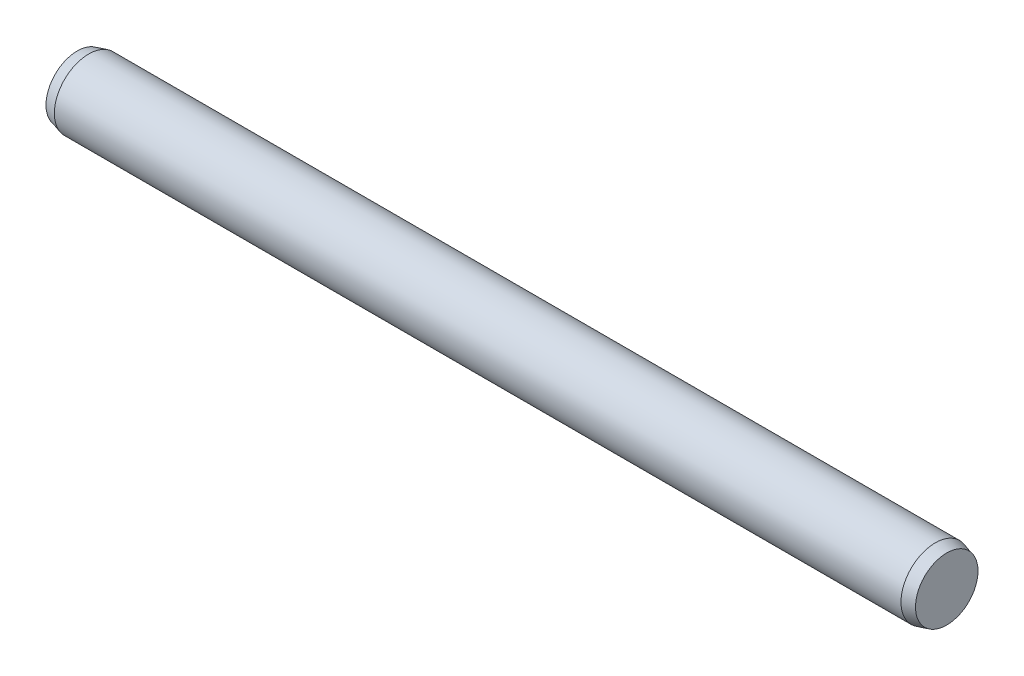
ISO-10303-21;
HEADER;
FILE_DESCRIPTION(('STEP AP214'),'2;1');
FILE_NAME('part.step','',(''),(''),'','','');
FILE_SCHEMA(('AUTOMOTIVE_DESIGN { 1 0 10303 214 1 1 1 1 }'));
ENDSEC;
DATA;
#1=APPLICATION_CONTEXT('core data for automotive mechanical design processes');
#2=APPLICATION_PROTOCOL_DEFINITION('international standard','automotive_design',2000,#1);
#3=PRODUCT_CONTEXT('',#1,'mechanical');
#4=PRODUCT('Part','Part','',(#3));
#5=PRODUCT_RELATED_PRODUCT_CATEGORY('part','',(#4));
#6=PRODUCT_DEFINITION_FORMATION('','',#4);
#7=PRODUCT_DEFINITION_CONTEXT('part definition',#1,'design');
#8=PRODUCT_DEFINITION('design','',#6,#7);
#9=PRODUCT_DEFINITION_SHAPE('','',#8);
#10=(LENGTH_UNIT() NAMED_UNIT(*) SI_UNIT(.MILLI.,.METRE.));
#11=(NAMED_UNIT(*) PLANE_ANGLE_UNIT() SI_UNIT($,.RADIAN.));
#12=(NAMED_UNIT(*) SI_UNIT($,.STERADIAN.) SOLID_ANGLE_UNIT());
#13=UNCERTAINTY_MEASURE_WITH_UNIT(LENGTH_MEASURE(1.E-05),#10,'distance_accuracy_value','');
#14=(GEOMETRIC_REPRESENTATION_CONTEXT(3) GLOBAL_UNCERTAINTY_ASSIGNED_CONTEXT((#13)) GLOBAL_UNIT_ASSIGNED_CONTEXT((#10,
#11,#12)) REPRESENTATION_CONTEXT('',''));
#15=CARTESIAN_POINT('',(0.,0.,0.));
#16=DIRECTION('',(0.,0.,1.));
#17=DIRECTION('',(1.,0.,0.));
#18=AXIS2_PLACEMENT_3D('',#15,#16,#17);
#19=CARTESIAN_POINT('',(-18.5,0.,0.));
#20=DIRECTION('',(1.,0.,0.));
#21=DIRECTION('',(0.,0.,-1.));
#22=AXIS2_PLACEMENT_3D('',#19,#20,#21);
#23=CYLINDRICAL_SURFACE('',#22,1.5);
#24=CARTESIAN_POINT('',(-18.5,0.,0.));
#25=DIRECTION('',(-1.,0.,0.));
#26=DIRECTION('',(0.,0.,1.));
#27=AXIS2_PLACEMENT_3D('',#24,#25,#26);
#28=CIRCLE('',#27,1.5);
#29=CARTESIAN_POINT('',(-18.5,0.,1.5));
#30=VERTEX_POINT('',#29);
#31=EDGE_CURVE('E49',#30,#30,#28,.T.);
#32=ORIENTED_EDGE('',*,*,#31,.F.);
#33=EDGE_LOOP('',(#32));
#34=FACE_BOUND('',#33,.T.);
#35=CARTESIAN_POINT('',(18.5,0.,0.));
#36=DIRECTION('',(1.,0.,0.));
#37=DIRECTION('',(0.,0.,-1.));
#38=AXIS2_PLACEMENT_3D('',#35,#36,#37);
#39=CIRCLE('',#38,1.5);
#40=CARTESIAN_POINT('',(18.5,0.,-1.5));
#41=VERTEX_POINT('',#40);
#42=EDGE_CURVE('E10',#41,#41,#39,.T.);
#43=ORIENTED_EDGE('',*,*,#42,.F.);
#44=EDGE_LOOP('',(#43));
#45=FACE_BOUND('',#44,.T.);
#46=ADVANCED_FACE('F35',(#34,#45),#23,.T.);
#47=CARTESIAN_POINT('',(18.5,0.,0.));
#48=DIRECTION('',(-1.,0.,0.));
#49=DIRECTION('',(0.,0.,-1.));
#50=AXIS2_PLACEMENT_3D('',#47,#48,#49);
#51=CONICAL_SURFACE('',#50,1.5,0.26179938779915);
#52=CARTESIAN_POINT('',(19.,0.,0.));
#53=DIRECTION('',(1.,0.,0.));
#54=DIRECTION('',(0.,0.,-1.));
#55=AXIS2_PLACEMENT_3D('',#52,#53,#54);
#56=CIRCLE('',#55,1.36602540378444);
#57=CARTESIAN_POINT('',(19.,0.,-1.36602540378444));
#58=VERTEX_POINT('',#57);
#59=EDGE_CURVE('E41',#58,#58,#56,.T.);
#60=ORIENTED_EDGE('',*,*,#59,.F.);
#61=EDGE_LOOP('',(#60));
#62=FACE_BOUND('',#61,.T.);
#63=ORIENTED_EDGE('',*,*,#42,.T.);
#64=EDGE_LOOP('',(#63));
#65=FACE_BOUND('',#64,.T.);
#66=ADVANCED_FACE('F59',(#62,#65),#51,.T.);
#67=CARTESIAN_POINT('',(19.,0.,0.));
#68=DIRECTION('',(1.,0.,0.));
#69=DIRECTION('',(0.,0.,-1.));
#70=AXIS2_PLACEMENT_3D('',#67,#68,#69);
#71=PLANE('',#70);
#72=ORIENTED_EDGE('',*,*,#59,.T.);
#73=EDGE_LOOP('',(#72));
#74=FACE_BOUND('',#73,.T.);
#75=ADVANCED_FACE('F63',(#74),#71,.T.);
#76=CARTESIAN_POINT('',(-18.5,0.,0.));
#77=DIRECTION('',(1.,0.,0.));
#78=DIRECTION('',(0.,0.,1.));
#79=AXIS2_PLACEMENT_3D('',#76,#77,#78);
#80=CONICAL_SURFACE('',#79,1.5,0.26179938779915);
#81=CARTESIAN_POINT('',(-19.,0.,0.));
#82=DIRECTION('',(-1.,0.,0.));
#83=DIRECTION('',(0.,0.,1.));
#84=AXIS2_PLACEMENT_3D('',#81,#82,#83);
#85=CIRCLE('',#84,1.36602540378444);
#86=CARTESIAN_POINT('',(-19.,0.,1.36602540378444));
#87=VERTEX_POINT('',#86);
#88=EDGE_CURVE('E45',#87,#87,#85,.T.);
#89=ORIENTED_EDGE('',*,*,#88,.F.);
#90=EDGE_LOOP('',(#89));
#91=FACE_BOUND('',#90,.T.);
#92=ORIENTED_EDGE('',*,*,#31,.T.);
#93=EDGE_LOOP('',(#92));
#94=FACE_BOUND('',#93,.T.);
#95=ADVANCED_FACE('F55',(#91,#94),#80,.T.);
#96=CARTESIAN_POINT('',(-19.,0.,0.));
#97=DIRECTION('',(-1.,0.,0.));
#98=DIRECTION('',(0.,0.,1.));
#99=AXIS2_PLACEMENT_3D('',#96,#97,#98);
#100=PLANE('',#99);
#101=ORIENTED_EDGE('',*,*,#88,.T.);
#102=EDGE_LOOP('',(#101));
#103=FACE_BOUND('',#102,.T.);
#104=ADVANCED_FACE('F72',(#103),#100,.T.);
#105=CLOSED_SHELL('',(#46,#66,#75,#95,#104));
#106=MANIFOLD_SOLID_BREP('B2',#105);
#107=ADVANCED_BREP_SHAPE_REPRESENTATION('',(#18,#106),#14);
#108=SHAPE_DEFINITION_REPRESENTATION(#9,#107);
ENDSEC;
END-ISO-10303-21;
